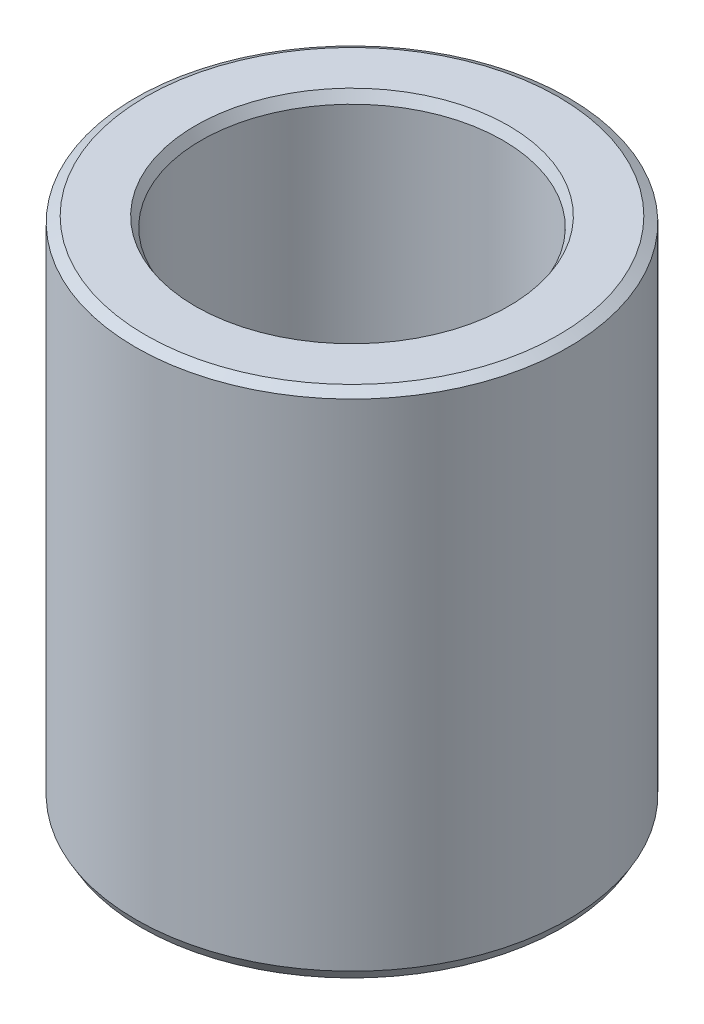
ISO-10303-21;
HEADER;
FILE_DESCRIPTION(('STEP AP214'),'2;1');
FILE_NAME('part.step','',(''),(''),'','','');
FILE_SCHEMA(('AUTOMOTIVE_DESIGN { 1 0 10303 214 1 1 1 1 }'));
ENDSEC;
DATA;
#1=APPLICATION_CONTEXT('core data for automotive mechanical design processes');
#2=APPLICATION_PROTOCOL_DEFINITION('international standard','automotive_design',2000,#1);
#3=PRODUCT_CONTEXT('',#1,'mechanical');
#4=PRODUCT('Part','Part','',(#3));
#5=PRODUCT_RELATED_PRODUCT_CATEGORY('part','',(#4));
#6=PRODUCT_DEFINITION_FORMATION('','',#4);
#7=PRODUCT_DEFINITION_CONTEXT('part definition',#1,'design');
#8=PRODUCT_DEFINITION('design','',#6,#7);
#9=PRODUCT_DEFINITION_SHAPE('','',#8);
#10=(LENGTH_UNIT() NAMED_UNIT(*) SI_UNIT(.MILLI.,.METRE.));
#11=(NAMED_UNIT(*) PLANE_ANGLE_UNIT() SI_UNIT($,.RADIAN.));
#12=(NAMED_UNIT(*) SI_UNIT($,.STERADIAN.) SOLID_ANGLE_UNIT());
#13=UNCERTAINTY_MEASURE_WITH_UNIT(LENGTH_MEASURE(1.E-05),#10,'distance_accuracy_value','');
#14=(GEOMETRIC_REPRESENTATION_CONTEXT(3) GLOBAL_UNCERTAINTY_ASSIGNED_CONTEXT((#13)) GLOBAL_UNIT_ASSIGNED_CONTEXT((#10,
#11,#12)) REPRESENTATION_CONTEXT('',''));
#15=CARTESIAN_POINT('',(0.,0.,0.));
#16=DIRECTION('',(0.,0.,1.));
#17=DIRECTION('',(1.,0.,0.));
#18=AXIS2_PLACEMENT_3D('',#15,#16,#17);
#19=CARTESIAN_POINT('',(0.,70.8983570436156,0.));
#20=DIRECTION('',(0.,-1.,0.));
#21=DIRECTION('',(0.,0.,-1.));
#22=AXIS2_PLACEMENT_3D('',#19,#20,#21);
#23=CYLINDRICAL_SURFACE('',#22,30.);
#24=CARTESIAN_POINT('',(0.,1.3705261387867,0.));
#25=DIRECTION('',(0.,1.,0.));
#26=DIRECTION('',(0.,0.,1.));
#27=AXIS2_PLACEMENT_3D('',#24,#25,#26);
#28=CIRCLE('',#27,30.);
#29=CARTESIAN_POINT('',(0.,1.3705261387867,-30.));
#30=VERTEX_POINT('',#29);
#31=EDGE_CURVE('E10',#30,#30,#28,.T.);
#32=CARTESIAN_POINT('',(0.,70.1070834084557,0.));
#33=DIRECTION('',(0.,1.,0.));
#34=DIRECTION('',(0.,0.,1.));
#35=AXIS2_PLACEMENT_3D('',#32,#33,#34);
#36=CIRCLE('',#35,30.);
#37=CARTESIAN_POINT('',(0.,70.1070834084557,-30.));
#38=VERTEX_POINT('',#37);
#39=EDGE_CURVE('E50',#38,#38,#36,.F.);
#40=CARTESIAN_POINT('',(0.,1.3705261387867,-30.));
#41=CARTESIAN_POINT('',(0.,2.08653194367909,-30.));
#42=CARTESIAN_POINT('',(0.,2.80253774857147,-30.));
#43=CARTESIAN_POINT('',(0.,4.23454935835624,-30.));
#44=CARTESIAN_POINT('',(0.,4.95055516324863,-30.));
#45=CARTESIAN_POINT('',(0.,6.3825667730334,-30.));
#46=CARTESIAN_POINT('',(0.,7.09857257792578,-30.));
#47=CARTESIAN_POINT('',(0.,8.53058418771055,-30.));
#48=CARTESIAN_POINT('',(0.,9.24658999260294,-30.));
#49=CARTESIAN_POINT('',(0.,10.6786016023877,-30.));
#50=CARTESIAN_POINT('',(0.,11.3946074072801,-30.));
#51=CARTESIAN_POINT('',(0.,12.8266190170649,-30.));
#52=CARTESIAN_POINT('',(0.,13.5426248219573,-30.));
#53=CARTESIAN_POINT('',(0.,14.974636431742,-30.));
#54=CARTESIAN_POINT('',(0.,15.6906422366344,-30.));
#55=CARTESIAN_POINT('',(0.,17.1226538464192,-30.));
#56=CARTESIAN_POINT('',(0.,17.8386596513116,-30.));
#57=CARTESIAN_POINT('',(0.,19.2706712610963,-30.));
#58=CARTESIAN_POINT('',(0.,19.9866770659887,-30.));
#59=CARTESIAN_POINT('',(0.,21.4186886757735,-30.));
#60=CARTESIAN_POINT('',(0.,22.1346944806659,-30.));
#61=CARTESIAN_POINT('',(0.,23.5667060904507,-30.));
#62=CARTESIAN_POINT('',(0.,24.282711895343,-30.));
#63=CARTESIAN_POINT('',(0.,25.7147235051278,-30.));
#64=CARTESIAN_POINT('',(0.,26.4307293100202,-30.));
#65=CARTESIAN_POINT('',(0.,27.862740919805,-30.));
#66=CARTESIAN_POINT('',(0.,28.5787467246974,-30.));
#67=CARTESIAN_POINT('',(0.,30.0107583344821,-30.));
#68=CARTESIAN_POINT('',(0.,30.7267641393745,-30.));
#69=CARTESIAN_POINT('',(0.,32.1587757491593,-30.));
#70=CARTESIAN_POINT('',(0.,32.8747815540517,-30.));
#71=CARTESIAN_POINT('',(0.,34.3067931638364,-30.));
#72=CARTESIAN_POINT('',(0.,35.0227989687288,-30.));
#73=CARTESIAN_POINT('',(0.,36.4548105785136,-30.));
#74=CARTESIAN_POINT('',(0.,37.170816383406,-30.));
#75=CARTESIAN_POINT('',(0.,38.6028279931908,-30.));
#76=CARTESIAN_POINT('',(0.,39.3188337980831,-30.));
#77=CARTESIAN_POINT('',(0.,40.7508454078679,-30.));
#78=CARTESIAN_POINT('',(0.,41.4668512127603,-30.));
#79=CARTESIAN_POINT('',(0.,42.8988628225451,-30.));
#80=CARTESIAN_POINT('',(0.,43.6148686274375,-30.));
#81=CARTESIAN_POINT('',(0.,45.0468802372222,-30.));
#82=CARTESIAN_POINT('',(0.,45.7628860421146,-30.));
#83=CARTESIAN_POINT('',(0.,47.1948976518994,-30.));
#84=CARTESIAN_POINT('',(0.,47.9109034567918,-30.));
#85=CARTESIAN_POINT('',(0.,49.3429150665765,-30.));
#86=CARTESIAN_POINT('',(0.,50.0589208714689,-30.));
#87=CARTESIAN_POINT('',(0.,51.4909324812537,-30.));
#88=CARTESIAN_POINT('',(0.,52.2069382861461,-30.));
#89=CARTESIAN_POINT('',(0.,53.6389498959309,-30.));
#90=CARTESIAN_POINT('',(0.,54.3549557008232,-30.));
#91=CARTESIAN_POINT('',(0.,55.786967310608,-30.));
#92=CARTESIAN_POINT('',(0.,56.5029731155004,-30.));
#93=CARTESIAN_POINT('',(0.,57.9349847252852,-30.));
#94=CARTESIAN_POINT('',(0.,58.6509905301776,-30.));
#95=CARTESIAN_POINT('',(0.,60.0830021399623,-30.));
#96=CARTESIAN_POINT('',(0.,60.7990079448547,-30.));
#97=CARTESIAN_POINT('',(0.,62.2310195546395,-30.));
#98=CARTESIAN_POINT('',(0.,62.9470253595319,-30.));
#99=CARTESIAN_POINT('',(0.,64.3790369693166,-30.));
#100=CARTESIAN_POINT('',(0.,65.095042774209,-30.));
#101=CARTESIAN_POINT('',(0.,66.5270543839938,-30.));
#102=CARTESIAN_POINT('',(0.,67.2430601888862,-30.));
#103=CARTESIAN_POINT('',(0.,68.675071798671,-30.));
#104=CARTESIAN_POINT('',(0.,69.3910776035633,-30.));
#105=CARTESIAN_POINT('',(0.,70.1070834084557,-30.));
#106=B_SPLINE_CURVE_WITH_KNOTS('',3,(#40,#41,#42,#43,#44,#45,#46,#47,#48,#49,#50,#51,#52,#53,
#54,#55,#56,#57,#58,#59,#60,#61,#62,#63,#64,#65,#66,#67,#68,#69,#70,#71,#72,#73,#74,#75,#76,#77,
#78,#79,#80,#81,#82,#83,#84,#85,#86,#87,#88,#89,#90,#91,#92,#93,#94,#95,#96,#97,#98,#99,#100,
#101,#102,#103,#104,#105),.UNSPECIFIED.,.F.,.F.,(4,2,2,2,2,2,2,2,2,2,2,2,2,2,2,2,2,2,2,2,2,2,2,
2,2,2,2,2,2,2,2,2,4),(0.,2.14801741467716,4.29603482935431,6.44405224403147,8.59206965870862,
10.7400870733858,12.8881044880629,15.0361219027401,17.1841393174173,19.3321567320944,
21.4801741467716,23.6281915614487,25.7762089761259,27.924226390803,30.0722438054802,
32.2202612201574,34.3682786348345,36.5162960495117,38.6643134641888,40.812330878866,
42.9603482935431,45.1083657082203,47.2563831228975,49.4044005375746,51.5524179522518,
53.7004353669289,55.8484527816061,57.9964701962832,60.1444876109604,62.2925050256376,
64.4405224403147,66.5885398549919,68.736557269669),.UNSPECIFIED.);
#107=EDGE_CURVE('BSEAM39',#30,#38,#106,.T.);
#108=ORIENTED_EDGE('',*,*,#31,.T.);
#109=ORIENTED_EDGE('',*,*,#39,.T.);
#110=ORIENTED_EDGE('',*,*,#107,.T.);
#111=ORIENTED_EDGE('',*,*,#107,.F.);
#112=EDGE_LOOP('',(#108,#110,#109,#111));
#113=FACE_BOUND('',#112,.T.);
#114=ADVANCED_FACE('F39',(#113),#23,.T.);
#115=CARTESIAN_POINT('',(0.,70.8983570436156,0.));
#116=DIRECTION('',(0.,1.,0.));
#117=DIRECTION('',(0.,0.,1.));
#118=AXIS2_PLACEMENT_3D('',#115,#116,#117);
#119=PLANE('',#118);
#120=CARTESIAN_POINT('',(0.,70.8983570436156,0.));
#121=DIRECTION('',(0.,1.,0.));
#122=DIRECTION('',(0.,0.,1.));
#123=AXIS2_PLACEMENT_3D('',#120,#121,#122);
#124=CIRCLE('',#123,21.7167512906906);
#125=CARTESIAN_POINT('',(0.,70.8983570436156,21.7167512906906));
#126=VERTEX_POINT('',#125);
#127=EDGE_CURVE('E58',#126,#126,#124,.F.);
#128=ORIENTED_EDGE('',*,*,#127,.T.);
#129=EDGE_LOOP('',(#128));
#130=FACE_BOUND('',#129,.T.);
#131=CARTESIAN_POINT('',(0.,70.8983570436156,0.));
#132=DIRECTION('',(0.,1.,0.));
#133=DIRECTION('',(0.,0.,1.));
#134=AXIS2_PLACEMENT_3D('',#131,#132,#133);
#135=CIRCLE('',#134,28.6294738612134);
#136=CARTESIAN_POINT('',(0.,70.8983570436156,28.6294738612134));
#137=VERTEX_POINT('',#136);
#138=EDGE_CURVE('E61',#137,#137,#135,.T.);
#139=ORIENTED_EDGE('',*,*,#138,.T.);
#140=EDGE_LOOP('',(#139));
#141=FACE_BOUND('',#140,.T.);
#142=ADVANCED_FACE('F88',(#130,#141),#119,.T.);
#143=CARTESIAN_POINT('',(0.,0.,0.));
#144=DIRECTION('',(0.,1.,0.));
#145=DIRECTION('',(0.,0.,1.));
#146=AXIS2_PLACEMENT_3D('',#143,#144,#145);
#147=PLANE('',#146);
#148=CARTESIAN_POINT('',(0.,0.,0.));
#149=DIRECTION('',(0.,1.,0.));
#150=DIRECTION('',(0.,0.,1.));
#151=AXIS2_PLACEMENT_3D('',#148,#149,#150);
#152=CIRCLE('',#151,22.2960037943173);
#153=CARTESIAN_POINT('',(0.,0.,22.2960037943173));
#154=VERTEX_POINT('',#153);
#155=EDGE_CURVE('E51',#154,#154,#152,.T.);
#156=ORIENTED_EDGE('',*,*,#155,.T.);
#157=EDGE_LOOP('',(#156));
#158=FACE_BOUND('',#157,.T.);
#159=CARTESIAN_POINT('',(0.,0.,0.));
#160=DIRECTION('',(0.,1.,0.));
#161=DIRECTION('',(0.,0.,1.));
#162=AXIS2_PLACEMENT_3D('',#159,#160,#161);
#163=CIRCLE('',#162,29.2087263648401);
#164=CARTESIAN_POINT('',(0.,0.,29.2087263648401));
#165=VERTEX_POINT('',#164);
#166=EDGE_CURVE('E54',#165,#165,#163,.F.);
#167=ORIENTED_EDGE('',*,*,#166,.T.);
#168=EDGE_LOOP('',(#167));
#169=FACE_BOUND('',#168,.T.);
#170=ADVANCED_FACE('F83',(#158,#169),#147,.F.);
#171=CARTESIAN_POINT('',(0.,70.8983570436156,0.));
#172=DIRECTION('',(0.,-1.,0.));
#173=DIRECTION('',(0.,0.,-1.));
#174=AXIS2_PLACEMENT_3D('',#171,#172,#173);
#175=CYLINDRICAL_SURFACE('',#174,20.9254776555307);
#176=CARTESIAN_POINT('',(0.,69.5278309048289,0.));
#177=DIRECTION('',(0.,1.,0.));
#178=DIRECTION('',(0.,0.,1.));
#179=AXIS2_PLACEMENT_3D('',#176,#177,#178);
#180=CIRCLE('',#179,20.9254776555307);
#181=CARTESIAN_POINT('',(0.,69.5278309048289,-20.9254776555307));
#182=VERTEX_POINT('',#181);
#183=EDGE_CURVE('E67',#182,#182,#180,.T.);
#184=CARTESIAN_POINT('',(0.,0.79127363515985,0.));
#185=DIRECTION('',(0.,1.,0.));
#186=DIRECTION('',(0.,0.,1.));
#187=AXIS2_PLACEMENT_3D('',#184,#185,#186);
#188=CIRCLE('',#187,20.9254776555307);
#189=CARTESIAN_POINT('',(0.,0.791273635159837,-20.9254776555307));
#190=VERTEX_POINT('',#189);
#191=EDGE_CURVE('E69',#190,#190,#188,.F.);
#192=CARTESIAN_POINT('',(0.,69.5278309048289,-20.9254776555307));
#193=CARTESIAN_POINT('',(0.,68.8118250999365,-20.9254776555307));
#194=CARTESIAN_POINT('',(0.,68.0958192950441,-20.9254776555307));
#195=CARTESIAN_POINT('',(0.,66.6638076852594,-20.9254776555307));
#196=CARTESIAN_POINT('',(0.,65.947801880367,-20.9254776555307));
#197=CARTESIAN_POINT('',(0.,64.5157902705822,-20.9254776555307));
#198=CARTESIAN_POINT('',(0.,63.7997844656898,-20.9254776555307));
#199=CARTESIAN_POINT('',(0.,62.3677728559051,-20.9254776555307));
#200=CARTESIAN_POINT('',(0.,61.6517670510127,-20.9254776555307));
#201=CARTESIAN_POINT('',(0.,60.2197554412279,-20.9254776555307));
#202=CARTESIAN_POINT('',(0.,59.5037496363355,-20.9254776555307));
#203=CARTESIAN_POINT('',(0.,58.0717380265507,-20.9254776555307));
#204=CARTESIAN_POINT('',(0.,57.3557322216584,-20.9254776555307));
#205=CARTESIAN_POINT('',(0.,55.9237206118736,-20.9254776555307));
#206=CARTESIAN_POINT('',(0.,55.2077148069812,-20.9254776555307));
#207=CARTESIAN_POINT('',(0.,53.7757031971964,-20.9254776555307));
#208=CARTESIAN_POINT('',(0.,53.059697392304,-20.9254776555307));
#209=CARTESIAN_POINT('',(0.,51.6276857825193,-20.9254776555307));
#210=CARTESIAN_POINT('',(0.,50.9116799776269,-20.9254776555307));
#211=CARTESIAN_POINT('',(0.,49.4796683678421,-20.9254776555307));
#212=CARTESIAN_POINT('',(0.,48.7636625629497,-20.9254776555307));
#213=CARTESIAN_POINT('',(0.,47.3316509531649,-20.9254776555307));
#214=CARTESIAN_POINT('',(0.,46.6156451482725,-20.9254776555307));
#215=CARTESIAN_POINT('',(0.,45.1836335384878,-20.9254776555307));
#216=CARTESIAN_POINT('',(0.,44.4676277335954,-20.9254776555307));
#217=CARTESIAN_POINT('',(0.,43.0356161238106,-20.9254776555307));
#218=CARTESIAN_POINT('',(0.,42.3196103189182,-20.9254776555307));
#219=CARTESIAN_POINT('',(0.,40.8875987091335,-20.9254776555307));
#220=CARTESIAN_POINT('',(0.,40.1715929042411,-20.9254776555307));
#221=CARTESIAN_POINT('',(0.,38.7395812944563,-20.9254776555307));
#222=CARTESIAN_POINT('',(0.,38.0235754895639,-20.9254776555307));
#223=CARTESIAN_POINT('',(0.,36.5915638797791,-20.9254776555307));
#224=CARTESIAN_POINT('',(0.,35.8755580748868,-20.9254776555307));
#225=CARTESIAN_POINT('',(0.,34.443546465102,-20.9254776555307));
#226=CARTESIAN_POINT('',(0.,33.7275406602096,-20.9254776555307));
#227=CARTESIAN_POINT('',(0.,32.2955290504248,-20.9254776555307));
#228=CARTESIAN_POINT('',(0.,31.5795232455324,-20.9254776555307));
#229=CARTESIAN_POINT('',(0.,30.1475116357477,-20.9254776555307));
#230=CARTESIAN_POINT('',(0.,29.4315058308553,-20.9254776555307));
#231=CARTESIAN_POINT('',(0.,27.9994942210705,-20.9254776555307));
#232=CARTESIAN_POINT('',(0.,27.2834884161781,-20.9254776555307));
#233=CARTESIAN_POINT('',(0.,25.8514768063934,-20.9254776555307));
#234=CARTESIAN_POINT('',(0.,25.135471001501,-20.9254776555307));
#235=CARTESIAN_POINT('',(0.,23.7034593917162,-20.9254776555307));
#236=CARTESIAN_POINT('',(0.,22.9874535868238,-20.9254776555307));
#237=CARTESIAN_POINT('',(0.,21.555441977039,-20.9254776555307));
#238=CARTESIAN_POINT('',(0.,20.8394361721467,-20.9254776555307));
#239=CARTESIAN_POINT('',(0.,19.4074245623619,-20.9254776555307));
#240=CARTESIAN_POINT('',(0.,18.6914187574695,-20.9254776555307));
#241=CARTESIAN_POINT('',(0.,17.2594071476847,-20.9254776555307));
#242=CARTESIAN_POINT('',(0.,16.5434013427923,-20.9254776555307));
#243=CARTESIAN_POINT('',(0.,15.1113897330076,-20.9254776555307));
#244=CARTESIAN_POINT('',(0.,14.3953839281152,-20.9254776555307));
#245=CARTESIAN_POINT('',(0.,12.9633723183304,-20.9254776555307));
#246=CARTESIAN_POINT('',(0.,12.247366513438,-20.9254776555307));
#247=CARTESIAN_POINT('',(0.,10.8153549036532,-20.9254776555307));
#248=CARTESIAN_POINT('',(0.,10.0993490987609,-20.9254776555307));
#249=CARTESIAN_POINT('',(0.,8.66733748897609,-20.9254776555307));
#250=CARTESIAN_POINT('',(0.,7.9513316840837,-20.9254776555307));
#251=CARTESIAN_POINT('',(0.,6.51932007429893,-20.9254776555307));
#252=CARTESIAN_POINT('',(0.,5.80331426940654,-20.9254776555307));
#253=CARTESIAN_POINT('',(0.,4.37130265962176,-20.9254776555307));
#254=CARTESIAN_POINT('',(0.,3.65529685472938,-20.9254776555307));
#255=CARTESIAN_POINT('',(0.,2.22328524494461,-20.9254776555307));
#256=CARTESIAN_POINT('',(0.,1.50727944005222,-20.9254776555307));
#257=CARTESIAN_POINT('',(0.,0.791273635159837,-20.9254776555307));
#258=B_SPLINE_CURVE_WITH_KNOTS('',3,(#192,#193,#194,#195,#196,#197,#198,#199,#200,#201,#202,
#203,#204,#205,#206,#207,#208,#209,#210,#211,#212,#213,#214,#215,#216,#217,#218,#219,#220,#221,
#222,#223,#224,#225,#226,#227,#228,#229,#230,#231,#232,#233,#234,#235,#236,#237,#238,#239,#240,
#241,#242,#243,#244,#245,#246,#247,#248,#249,#250,#251,#252,#253,#254,#255,#256,#257),
.UNSPECIFIED.,.F.,.F.,(4,2,2,2,2,2,2,2,2,2,2,2,2,2,2,2,2,2,2,2,2,2,2,2,2,2,2,2,2,2,2,2,4),(0.,
2.14801741467716,4.29603482935431,6.44405224403147,8.59206965870862,10.7400870733858,
12.8881044880629,15.0361219027401,17.1841393174173,19.3321567320944,21.4801741467716,
23.6281915614487,25.7762089761259,27.9242263908031,30.0722438054802,32.2202612201574,
34.3682786348345,36.5162960495117,38.6643134641888,40.812330878866,42.9603482935432,
45.1083657082203,47.2563831228975,49.4044005375746,51.5524179522518,53.700435366929,
55.8484527816061,57.9964701962833,60.1444876109604,62.2925050256376,64.4405224403148,
66.5885398549919,68.7365572696691),.UNSPECIFIED.);
#259=EDGE_CURVE('BSEAM71',#182,#190,#258,.T.);
#260=ORIENTED_EDGE('',*,*,#183,.T.);
#261=ORIENTED_EDGE('',*,*,#191,.T.);
#262=ORIENTED_EDGE('',*,*,#259,.T.);
#263=ORIENTED_EDGE('',*,*,#259,.F.);
#264=EDGE_LOOP('',(#260,#262,#261,#263));
#265=FACE_BOUND('',#264,.T.);
#266=ADVANCED_FACE('F71',(#265),#175,.F.);
#267=CARTESIAN_POINT('',(0.,69.5278309048289,0.));
#268=DIRECTION('',(0.,1.,0.));
#269=DIRECTION('',(0.,0.,1.));
#270=AXIS2_PLACEMENT_3D('',#267,#268,#269);
#271=CONICAL_SURFACE('',#270,20.9254776555307,0.523598775598295);
#272=ORIENTED_EDGE('',*,*,#127,.F.);
#273=EDGE_LOOP('',(#272));
#274=FACE_BOUND('',#273,.T.);
#275=ORIENTED_EDGE('',*,*,#183,.F.);
#276=EDGE_LOOP('',(#275));
#277=FACE_BOUND('',#276,.T.);
#278=ADVANCED_FACE('F77',(#274,#277),#271,.F.);
#279=CARTESIAN_POINT('',(0.,0.,0.));
#280=DIRECTION('',(0.,-1.,0.));
#281=DIRECTION('',(0.,0.,-1.));
#282=AXIS2_PLACEMENT_3D('',#279,#280,#281);
#283=CONICAL_SURFACE('',#282,22.2960037943173,1.04719755119659);
#284=ORIENTED_EDGE('',*,*,#191,.F.);
#285=EDGE_LOOP('',(#284));
#286=FACE_BOUND('',#285,.T.);
#287=ORIENTED_EDGE('',*,*,#155,.F.);
#288=EDGE_LOOP('',(#287));
#289=FACE_BOUND('',#288,.T.);
#290=ADVANCED_FACE('F73',(#286,#289),#283,.F.);
#291=CARTESIAN_POINT('',(0.,1.3705261387867,0.));
#292=DIRECTION('',(0.,1.,0.));
#293=DIRECTION('',(0.,0.,1.));
#294=AXIS2_PLACEMENT_3D('',#291,#292,#293);
#295=CONICAL_SURFACE('',#294,30.,0.5235987755983);
#296=ORIENTED_EDGE('',*,*,#166,.F.);
#297=EDGE_LOOP('',(#296));
#298=FACE_BOUND('',#297,.T.);
#299=ORIENTED_EDGE('',*,*,#31,.F.);
#300=EDGE_LOOP('',(#299));
#301=FACE_BOUND('',#300,.T.);
#302=ADVANCED_FACE('F76',(#298,#301),#295,.T.);
#303=CARTESIAN_POINT('',(0.,70.8983570436156,0.));
#304=DIRECTION('',(0.,-1.,0.));
#305=DIRECTION('',(0.,0.,-1.));
#306=AXIS2_PLACEMENT_3D('',#303,#304,#305);
#307=CONICAL_SURFACE('',#306,28.6294738612134,1.04719755119659);
#308=ORIENTED_EDGE('',*,*,#39,.F.);
#309=EDGE_LOOP('',(#308));
#310=FACE_BOUND('',#309,.T.);
#311=ORIENTED_EDGE('',*,*,#138,.F.);
#312=EDGE_LOOP('',(#311));
#313=FACE_BOUND('',#312,.T.);
#314=ADVANCED_FACE('F45',(#310,#313),#307,.T.);
#315=CLOSED_SHELL('',(#114,#142,#170,#266,#278,#290,#302,#314));
#316=MANIFOLD_SOLID_BREP('B2',#315);
#317=ADVANCED_BREP_SHAPE_REPRESENTATION('',(#18,#316),#14);
#318=SHAPE_DEFINITION_REPRESENTATION(#9,#317);
ENDSEC;
END-ISO-10303-21;
